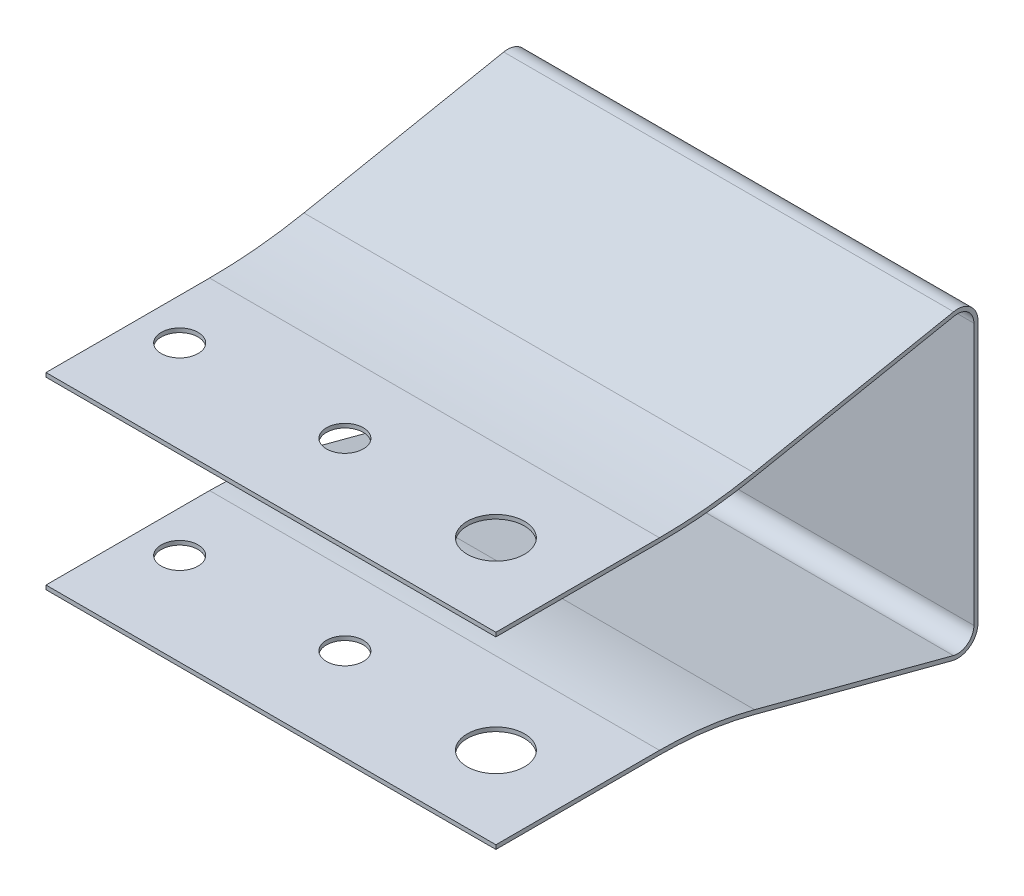
ISO-10303-21;
HEADER;
FILE_DESCRIPTION(('STEP AP214'),'2;1');
FILE_NAME('part.step','',(''),(''),'','','');
FILE_SCHEMA(('AUTOMOTIVE_DESIGN { 1 0 10303 214 1 1 1 1 }'));
ENDSEC;
DATA;
#1=APPLICATION_CONTEXT('core data for automotive mechanical design processes');
#2=APPLICATION_PROTOCOL_DEFINITION('international standard','automotive_design',2000,#1);
#3=PRODUCT_CONTEXT('',#1,'mechanical');
#4=PRODUCT('Part','Part','',(#3));
#5=PRODUCT_RELATED_PRODUCT_CATEGORY('part','',(#4));
#6=PRODUCT_DEFINITION_FORMATION('','',#4);
#7=PRODUCT_DEFINITION_CONTEXT('part definition',#1,'design');
#8=PRODUCT_DEFINITION('design','',#6,#7);
#9=PRODUCT_DEFINITION_SHAPE('','',#8);
#10=(LENGTH_UNIT() NAMED_UNIT(*) SI_UNIT(.MILLI.,.METRE.));
#11=(NAMED_UNIT(*) PLANE_ANGLE_UNIT() SI_UNIT($,.RADIAN.));
#12=(NAMED_UNIT(*) SI_UNIT($,.STERADIAN.) SOLID_ANGLE_UNIT());
#13=UNCERTAINTY_MEASURE_WITH_UNIT(LENGTH_MEASURE(1.E-05),#10,'distance_accuracy_value','');
#14=(GEOMETRIC_REPRESENTATION_CONTEXT(3) GLOBAL_UNCERTAINTY_ASSIGNED_CONTEXT((#13)) GLOBAL_UNIT_ASSIGNED_CONTEXT((#10,
#11,#12)) REPRESENTATION_CONTEXT('',''));
#15=CARTESIAN_POINT('',(0.,0.,0.));
#16=DIRECTION('',(0.,0.,1.));
#17=DIRECTION('',(1.,0.,0.));
#18=AXIS2_PLACEMENT_3D('',#15,#16,#17);
#19=CARTESIAN_POINT('',(13.75,8.,-23.22));
#20=DIRECTION('',(-1.,0.,0.));
#21=DIRECTION('',(0.,0.,-1.));
#22=AXIS2_PLACEMENT_3D('',#19,#20,#21);
#23=CYLINDRICAL_SURFACE('',#22,1.);
#24=CARTESIAN_POINT('',(-13.75,8.,-23.22));
#25=DIRECTION('',(1.,0.,0.));
#26=DIRECTION('',(0.,0.,1.));
#27=AXIS2_PLACEMENT_3D('',#24,#25,#26);
#28=CIRCLE('',#27,1.);
#29=CARTESIAN_POINT('',(-13.75,8.,-24.22));
#30=VERTEX_POINT('',#29);
#31=CARTESIAN_POINT('',(-13.75,8.98104394957776,-23.0262146316233));
#32=VERTEX_POINT('',#31);
#33=EDGE_CURVE('E204',#30,#32,#28,.T.);
#34=ORIENTED_EDGE('',*,*,#33,.F.);
#35=DIRECTION('',(-1.,0.,0.));
#36=VECTOR('',#35,1.);
#37=CARTESIAN_POINT('',(13.75,8.,-24.22));
#38=LINE('',#37,#36);
#39=CARTESIAN_POINT('',(13.75,8.,-24.22));
#40=VERTEX_POINT('',#39);
#41=EDGE_CURVE('E203',#40,#30,#38,.T.);
#42=ORIENTED_EDGE('',*,*,#41,.F.);
#43=CARTESIAN_POINT('',(13.75,8.,-23.22));
#44=DIRECTION('',(1.,0.,0.));
#45=DIRECTION('',(0.,0.,1.));
#46=AXIS2_PLACEMENT_3D('',#43,#44,#45);
#47=CIRCLE('',#46,1.);
#48=CARTESIAN_POINT('',(13.75,8.98104394957776,-23.0262146316233));
#49=VERTEX_POINT('',#48);
#50=EDGE_CURVE('E259',#40,#49,#47,.T.);
#51=ORIENTED_EDGE('',*,*,#50,.T.);
#52=DIRECTION('',(-1.,0.,0.));
#53=VECTOR('',#52,1.);
#54=CARTESIAN_POINT('',(13.75,8.98104394957776,-23.0262146316233));
#55=LINE('',#54,#53);
#56=EDGE_CURVE('E11',#49,#32,#55,.T.);
#57=ORIENTED_EDGE('',*,*,#56,.T.);
#58=EDGE_LOOP('',(#34,#42,#51,#57));
#59=FACE_BOUND('',#58,.T.);
#60=ADVANCED_FACE('F34',(#59),#23,.F.);
#61=CARTESIAN_POINT('',(13.75,6.56868151266737,-10.8135610513));
#62=DIRECTION('',(0.,0.981043949577755,0.193785368376667));
#63=DIRECTION('',(0.,0.193785368376667,-0.981043949577754));
#64=AXIS2_PLACEMENT_3D('',#61,#62,#63);
#65=PLANE('',#64);
#66=DIRECTION('',(0.,-0.193785368376667,0.981043949577754));
#67=VECTOR('',#66,1.);
#68=CARTESIAN_POINT('',(-13.75,6.56868151266737,-10.8135610513));
#69=LINE('',#68,#67);
#70=CARTESIAN_POINT('',(-13.75,6.56868151266737,-10.8135610513));
#71=VERTEX_POINT('',#70);
#72=EDGE_CURVE('E206',#32,#71,#69,.T.);
#73=ORIENTED_EDGE('',*,*,#72,.F.);
#74=ORIENTED_EDGE('',*,*,#56,.F.);
#75=DIRECTION('',(0.,-0.193785368376667,0.981043949577754));
#76=VECTOR('',#75,1.);
#77=CARTESIAN_POINT('',(13.75,6.56868151266737,-10.8135610513));
#78=LINE('',#77,#76);
#79=CARTESIAN_POINT('',(13.75,6.56868151266737,-10.8135610513));
#80=VERTEX_POINT('',#79);
#81=EDGE_CURVE('E126',#49,#80,#78,.T.);
#82=ORIENTED_EDGE('',*,*,#81,.T.);
#83=DIRECTION('',(-1.,0.,0.));
#84=VECTOR('',#83,1.);
#85=CARTESIAN_POINT('',(13.75,6.56868151266737,-10.8135610513));
#86=LINE('',#85,#84);
#87=EDGE_CURVE('E43',#80,#71,#86,.T.);
#88=ORIENTED_EDGE('',*,*,#87,.T.);
#89=EDGE_LOOP('',(#73,#74,#82,#88));
#90=FACE_BOUND('',#89,.T.);
#91=ADVANCED_FACE('F430',(#90),#65,.F.);
#92=CARTESIAN_POINT('',(13.75,36.,-5.));
#93=DIRECTION('',(-1.,0.,0.));
#94=DIRECTION('',(0.,0.,-1.));
#95=AXIS2_PLACEMENT_3D('',#92,#93,#94);
#96=CYLINDRICAL_SURFACE('',#95,30.);
#97=CARTESIAN_POINT('',(-13.75,36.,-5.));
#98=DIRECTION('',(-1.,0.,0.));
#99=DIRECTION('',(0.,0.,-1.));
#100=AXIS2_PLACEMENT_3D('',#97,#98,#99);
#101=CIRCLE('',#100,30.);
#102=CARTESIAN_POINT('',(-13.75,6.,-5.));
#103=VERTEX_POINT('',#102);
#104=EDGE_CURVE('E210',#71,#103,#101,.T.);
#105=ORIENTED_EDGE('',*,*,#104,.F.);
#106=ORIENTED_EDGE('',*,*,#87,.F.);
#107=CARTESIAN_POINT('',(13.75,36.,-5.));
#108=DIRECTION('',(-1.,0.,0.));
#109=DIRECTION('',(0.,0.,-1.));
#110=AXIS2_PLACEMENT_3D('',#107,#108,#109);
#111=CIRCLE('',#110,30.);
#112=CARTESIAN_POINT('',(13.75,6.,-5.));
#113=VERTEX_POINT('',#112);
#114=EDGE_CURVE('E344',#80,#113,#111,.T.);
#115=ORIENTED_EDGE('',*,*,#114,.T.);
#116=DIRECTION('',(-1.,0.,0.));
#117=VECTOR('',#116,1.);
#118=CARTESIAN_POINT('',(13.75,6.,-5.));
#119=LINE('',#118,#117);
#120=EDGE_CURVE('E302',#113,#103,#119,.T.);
#121=ORIENTED_EDGE('',*,*,#120,.T.);
#122=EDGE_LOOP('',(#105,#106,#115,#121));
#123=FACE_BOUND('',#122,.T.);
#124=ADVANCED_FACE('F428',(#123),#96,.T.);
#125=CARTESIAN_POINT('',(13.75,6.,-5.));
#126=DIRECTION('',(0.,1.,0.));
#127=DIRECTION('',(0.,0.,-1.));
#128=AXIS2_PLACEMENT_3D('',#125,#126,#127);
#129=PLANE('',#128);
#130=CARTESIAN_POINT('',(-11.23,6.,-0.650000000000002));
#131=DIRECTION('',(0.,-1.,0.));
#132=DIRECTION('',(0.,0.,-1.));
#133=AXIS2_PLACEMENT_3D('',#130,#131,#132);
#134=CIRCLE('',#133,1.125);
#135=CARTESIAN_POINT('',(-11.23,6.,-1.775));
#136=VERTEX_POINT('',#135);
#137=EDGE_CURVE('E314',#136,#136,#134,.T.);
#138=ORIENTED_EDGE('',*,*,#137,.F.);
#139=EDGE_LOOP('',(#138));
#140=FACE_BOUND('',#139,.T.);
#141=CARTESIAN_POINT('',(-1.13,6.,-0.650000000000001));
#142=DIRECTION('',(0.,-1.,0.));
#143=DIRECTION('',(0.,0.,-1.));
#144=AXIS2_PLACEMENT_3D('',#141,#142,#143);
#145=CIRCLE('',#144,1.125);
#146=CARTESIAN_POINT('',(-1.13,6.,-1.775));
#147=VERTEX_POINT('',#146);
#148=EDGE_CURVE('E310',#147,#147,#145,.T.);
#149=ORIENTED_EDGE('',*,*,#148,.F.);
#150=EDGE_LOOP('',(#149));
#151=FACE_BOUND('',#150,.T.);
#152=CARTESIAN_POINT('',(8.75,6.,0.));
#153=DIRECTION('',(0.,-1.,0.));
#154=DIRECTION('',(0.,0.,-1.));
#155=AXIS2_PLACEMENT_3D('',#152,#153,#154);
#156=CIRCLE('',#155,1.75);
#157=CARTESIAN_POINT('',(8.75,6.,-1.75));
#158=VERTEX_POINT('',#157);
#159=EDGE_CURVE('E207',#158,#158,#156,.T.);
#160=ORIENTED_EDGE('',*,*,#159,.F.);
#161=EDGE_LOOP('',(#160));
#162=FACE_BOUND('',#161,.T.);
#163=DIRECTION('',(0.,0.,1.));
#164=VECTOR('',#163,1.);
#165=CARTESIAN_POINT('',(-13.75,6.,-5.));
#166=LINE('',#165,#164);
#167=CARTESIAN_POINT('',(-13.75,6.,5.));
#168=VERTEX_POINT('',#167);
#169=EDGE_CURVE('E213',#103,#168,#166,.T.);
#170=ORIENTED_EDGE('',*,*,#169,.F.);
#171=ORIENTED_EDGE('',*,*,#120,.F.);
#172=DIRECTION('',(0.,0.,1.));
#173=VECTOR('',#172,1.);
#174=CARTESIAN_POINT('',(13.75,6.,-5.));
#175=LINE('',#174,#173);
#176=CARTESIAN_POINT('',(13.75,6.,5.));
#177=VERTEX_POINT('',#176);
#178=EDGE_CURVE('E347',#113,#177,#175,.T.);
#179=ORIENTED_EDGE('',*,*,#178,.T.);
#180=DIRECTION('',(-1.,0.,0.));
#181=VECTOR('',#180,1.);
#182=CARTESIAN_POINT('',(13.75,6.,5.));
#183=LINE('',#182,#181);
#184=EDGE_CURVE('E299',#177,#168,#183,.T.);
#185=ORIENTED_EDGE('',*,*,#184,.T.);
#186=EDGE_LOOP('',(#170,#171,#179,#185));
#187=FACE_BOUND('',#186,.T.);
#188=ADVANCED_FACE('F426',(#140,#151,#162,#187),#129,.F.);
#189=CARTESIAN_POINT('',(13.75,6.25,5.));
#190=DIRECTION('',(0.,0.,-1.));
#191=DIRECTION('',(1.,0.,0.));
#192=AXIS2_PLACEMENT_3D('',#189,#190,#191);
#193=PLANE('',#192);
#194=DIRECTION('',(0.,1.,0.));
#195=VECTOR('',#194,1.);
#196=CARTESIAN_POINT('',(-13.75,6.25,5.));
#197=LINE('',#196,#195);
#198=CARTESIAN_POINT('',(-13.75,6.25,5.));
#199=VERTEX_POINT('',#198);
#200=EDGE_CURVE('E216',#168,#199,#197,.T.);
#201=ORIENTED_EDGE('',*,*,#200,.F.);
#202=ORIENTED_EDGE('',*,*,#184,.F.);
#203=DIRECTION('',(0.,1.,0.));
#204=VECTOR('',#203,1.);
#205=CARTESIAN_POINT('',(13.75,6.25,5.));
#206=LINE('',#205,#204);
#207=CARTESIAN_POINT('',(13.75,6.25,5.));
#208=VERTEX_POINT('',#207);
#209=EDGE_CURVE('E350',#177,#208,#206,.T.);
#210=ORIENTED_EDGE('',*,*,#209,.T.);
#211=DIRECTION('',(-1.,0.,0.));
#212=VECTOR('',#211,1.);
#213=CARTESIAN_POINT('',(13.75,6.25,5.));
#214=LINE('',#213,#212);
#215=EDGE_CURVE('E296',#208,#199,#214,.T.);
#216=ORIENTED_EDGE('',*,*,#215,.T.);
#217=EDGE_LOOP('',(#201,#202,#210,#216));
#218=FACE_BOUND('',#217,.T.);
#219=ADVANCED_FACE('F422',(#218),#193,.F.);
#220=CARTESIAN_POINT('',(13.75,6.25,-5.));
#221=DIRECTION('',(0.,-1.,0.));
#222=DIRECTION('',(0.,0.,1.));
#223=AXIS2_PLACEMENT_3D('',#220,#221,#222);
#224=PLANE('',#223);
#225=CARTESIAN_POINT('',(-11.23,6.25,-0.650000000000002));
#226=DIRECTION('',(0.,1.,0.));
#227=DIRECTION('',(0.,0.,1.));
#228=AXIS2_PLACEMENT_3D('',#225,#226,#227);
#229=CIRCLE('',#228,1.125);
#230=CARTESIAN_POINT('',(-11.23,6.25,0.475));
#231=VERTEX_POINT('',#230);
#232=EDGE_CURVE('E321',#231,#231,#229,.T.);
#233=ORIENTED_EDGE('',*,*,#232,.F.);
#234=EDGE_LOOP('',(#233));
#235=FACE_BOUND('',#234,.T.);
#236=CARTESIAN_POINT('',(-1.13,6.25,-0.650000000000001));
#237=DIRECTION('',(0.,1.,0.));
#238=DIRECTION('',(0.,0.,1.));
#239=AXIS2_PLACEMENT_3D('',#236,#237,#238);
#240=CIRCLE('',#239,1.125);
#241=CARTESIAN_POINT('',(-1.13,6.25,0.474999999999999));
#242=VERTEX_POINT('',#241);
#243=EDGE_CURVE('E318',#242,#242,#240,.T.);
#244=ORIENTED_EDGE('',*,*,#243,.F.);
#245=EDGE_LOOP('',(#244));
#246=FACE_BOUND('',#245,.T.);
#247=CARTESIAN_POINT('',(8.75,6.25,0.));
#248=DIRECTION('',(0.,1.,0.));
#249=DIRECTION('',(0.,0.,1.));
#250=AXIS2_PLACEMENT_3D('',#247,#248,#249);
#251=CIRCLE('',#250,1.75);
#252=CARTESIAN_POINT('',(8.75,6.25,1.75));
#253=VERTEX_POINT('',#252);
#254=EDGE_CURVE('E336',#253,#253,#251,.T.);
#255=ORIENTED_EDGE('',*,*,#254,.F.);
#256=EDGE_LOOP('',(#255));
#257=FACE_BOUND('',#256,.T.);
#258=DIRECTION('',(0.,0.,-1.));
#259=VECTOR('',#258,1.);
#260=CARTESIAN_POINT('',(-13.75,6.25,-5.));
#261=LINE('',#260,#259);
#262=CARTESIAN_POINT('',(-13.75,6.25,-4.99999999999999));
#263=VERTEX_POINT('',#262);
#264=EDGE_CURVE('E219',#199,#263,#261,.T.);
#265=ORIENTED_EDGE('',*,*,#264,.F.);
#266=ORIENTED_EDGE('',*,*,#215,.F.);
#267=DIRECTION('',(0.,0.,-1.));
#268=VECTOR('',#267,1.);
#269=CARTESIAN_POINT('',(13.75,6.25,-5.));
#270=LINE('',#269,#268);
#271=CARTESIAN_POINT('',(13.75,6.25,-4.99999999999999));
#272=VERTEX_POINT('',#271);
#273=EDGE_CURVE('E353',#208,#272,#270,.T.);
#274=ORIENTED_EDGE('',*,*,#273,.T.);
#275=DIRECTION('',(-1.,0.,0.));
#276=VECTOR('',#275,1.);
#277=CARTESIAN_POINT('',(13.75,6.25,-4.99999999999999));
#278=LINE('',#277,#276);
#279=EDGE_CURVE('E293',#272,#263,#278,.T.);
#280=ORIENTED_EDGE('',*,*,#279,.T.);
#281=EDGE_LOOP('',(#265,#266,#274,#280));
#282=FACE_BOUND('',#281,.T.);
#283=ADVANCED_FACE('F419',(#235,#246,#257,#282),#224,.F.);
#284=CARTESIAN_POINT('',(13.75,36.,-5.));
#285=DIRECTION('',(-1.,0.,0.));
#286=DIRECTION('',(0.,0.,-1.));
#287=AXIS2_PLACEMENT_3D('',#284,#285,#286);
#288=CYLINDRICAL_SURFACE('',#287,29.75);
#289=CARTESIAN_POINT('',(-13.75,36.,-5.));
#290=DIRECTION('',(1.,0.,0.));
#291=DIRECTION('',(0.,0.,-1.));
#292=AXIS2_PLACEMENT_3D('',#289,#290,#291);
#293=CIRCLE('',#292,29.75);
#294=CARTESIAN_POINT('',(-13.75,6.81394250006181,-10.7651147092058));
#295=VERTEX_POINT('',#294);
#296=EDGE_CURVE('E222',#263,#295,#293,.T.);
#297=ORIENTED_EDGE('',*,*,#296,.F.);
#298=ORIENTED_EDGE('',*,*,#279,.F.);
#299=CARTESIAN_POINT('',(13.75,36.,-5.));
#300=DIRECTION('',(1.,0.,0.));
#301=DIRECTION('',(0.,0.,-1.));
#302=AXIS2_PLACEMENT_3D('',#299,#300,#301);
#303=CIRCLE('',#302,29.75);
#304=CARTESIAN_POINT('',(13.75,6.81394250006181,-10.7651147092058));
#305=VERTEX_POINT('',#304);
#306=EDGE_CURVE('E356',#272,#305,#303,.T.);
#307=ORIENTED_EDGE('',*,*,#306,.T.);
#308=DIRECTION('',(-1.,0.,0.));
#309=VECTOR('',#308,1.);
#310=CARTESIAN_POINT('',(13.75,6.81394250006181,-10.7651147092058));
#311=LINE('',#310,#309);
#312=EDGE_CURVE('E290',#305,#295,#311,.T.);
#313=ORIENTED_EDGE('',*,*,#312,.T.);
#314=EDGE_LOOP('',(#297,#298,#307,#313));
#315=FACE_BOUND('',#314,.T.);
#316=ADVANCED_FACE('F417',(#315),#288,.F.);
#317=CARTESIAN_POINT('',(13.75,6.81394250006181,-10.7651147092058));
#318=DIRECTION('',(0.,-0.981043949577754,-0.193785368376668));
#319=DIRECTION('',(0.,-0.193785368376668,0.981043949577754));
#320=AXIS2_PLACEMENT_3D('',#317,#318,#319);
#321=PLANE('',#320);
#322=DIRECTION('',(0.,0.193785368376668,-0.981043949577754));
#323=VECTOR('',#322,1.);
#324=CARTESIAN_POINT('',(-13.75,6.81394250006181,-10.7651147092058));
#325=LINE('',#324,#323);
#326=CARTESIAN_POINT('',(-13.75,9.22630493697219,-22.9777682895292));
#327=VERTEX_POINT('',#326);
#328=EDGE_CURVE('E225',#295,#327,#325,.T.);
#329=ORIENTED_EDGE('',*,*,#328,.F.);
#330=ORIENTED_EDGE('',*,*,#312,.F.);
#331=DIRECTION('',(0.,0.193785368376668,-0.981043949577754));
#332=VECTOR('',#331,1.);
#333=CARTESIAN_POINT('',(13.75,6.81394250006181,-10.7651147092058));
#334=LINE('',#333,#332);
#335=CARTESIAN_POINT('',(13.75,9.22630493697219,-22.9777682895292));
#336=VERTEX_POINT('',#335);
#337=EDGE_CURVE('E359',#305,#336,#334,.T.);
#338=ORIENTED_EDGE('',*,*,#337,.T.);
#339=DIRECTION('',(-1.,0.,0.));
#340=VECTOR('',#339,1.);
#341=CARTESIAN_POINT('',(13.75,9.22630493697219,-22.9777682895292));
#342=LINE('',#341,#340);
#343=EDGE_CURVE('E287',#336,#327,#342,.T.);
#344=ORIENTED_EDGE('',*,*,#343,.T.);
#345=EDGE_LOOP('',(#329,#330,#338,#344));
#346=FACE_BOUND('',#345,.T.);
#347=ADVANCED_FACE('F413',(#346),#321,.F.);
#348=CARTESIAN_POINT('',(13.75,8.,-23.22));
#349=DIRECTION('',(-1.,0.,0.));
#350=DIRECTION('',(0.,0.,-1.));
#351=AXIS2_PLACEMENT_3D('',#348,#349,#350);
#352=CYLINDRICAL_SURFACE('',#351,1.25);
#353=CARTESIAN_POINT('',(-13.75,8.,-23.22));
#354=DIRECTION('',(-1.,0.,0.));
#355=DIRECTION('',(0.,0.,1.));
#356=AXIS2_PLACEMENT_3D('',#353,#354,#355);
#357=CIRCLE('',#356,1.25);
#358=CARTESIAN_POINT('',(-13.75,8.,-24.47));
#359=VERTEX_POINT('',#358);
#360=EDGE_CURVE('E228',#327,#359,#357,.T.);
#361=ORIENTED_EDGE('',*,*,#360,.F.);
#362=ORIENTED_EDGE('',*,*,#343,.F.);
#363=CARTESIAN_POINT('',(13.75,8.,-23.22));
#364=DIRECTION('',(-1.,0.,0.));
#365=DIRECTION('',(0.,0.,1.));
#366=AXIS2_PLACEMENT_3D('',#363,#364,#365);
#367=CIRCLE('',#366,1.25);
#368=CARTESIAN_POINT('',(13.75,8.,-24.47));
#369=VERTEX_POINT('',#368);
#370=EDGE_CURVE('E362',#336,#369,#367,.T.);
#371=ORIENTED_EDGE('',*,*,#370,.T.);
#372=DIRECTION('',(-1.,0.,0.));
#373=VECTOR('',#372,1.);
#374=CARTESIAN_POINT('',(13.75,8.,-24.47));
#375=LINE('',#374,#373);
#376=EDGE_CURVE('E284',#369,#359,#375,.T.);
#377=ORIENTED_EDGE('',*,*,#376,.T.);
#378=EDGE_LOOP('',(#361,#362,#371,#377));
#379=FACE_BOUND('',#378,.T.);
#380=ADVANCED_FACE('F410',(#379),#352,.T.);
#381=CARTESIAN_POINT('',(13.75,8.,-24.47));
#382=DIRECTION('',(0.,0.,1.));
#383=DIRECTION('',(-1.,0.,0.));
#384=AXIS2_PLACEMENT_3D('',#381,#382,#383);
#385=PLANE('',#384);
#386=DIRECTION('',(0.,-1.,0.));
#387=VECTOR('',#386,1.);
#388=CARTESIAN_POINT('',(-13.75,8.,-24.47));
#389=LINE('',#388,#387);
#390=CARTESIAN_POINT('',(-13.75,-8.,-24.47));
#391=VERTEX_POINT('',#390);
#392=EDGE_CURVE('E231',#359,#391,#389,.T.);
#393=ORIENTED_EDGE('',*,*,#392,.F.);
#394=ORIENTED_EDGE('',*,*,#376,.F.);
#395=DIRECTION('',(0.,-1.,0.));
#396=VECTOR('',#395,1.);
#397=CARTESIAN_POINT('',(13.75,8.,-24.47));
#398=LINE('',#397,#396);
#399=CARTESIAN_POINT('',(13.75,-8.,-24.47));
#400=VERTEX_POINT('',#399);
#401=EDGE_CURVE('E365',#369,#400,#398,.T.);
#402=ORIENTED_EDGE('',*,*,#401,.T.);
#403=DIRECTION('',(-1.,0.,0.));
#404=VECTOR('',#403,1.);
#405=CARTESIAN_POINT('',(13.75,-8.,-24.47));
#406=LINE('',#405,#404);
#407=EDGE_CURVE('E281',#400,#391,#406,.T.);
#408=ORIENTED_EDGE('',*,*,#407,.T.);
#409=EDGE_LOOP('',(#393,#394,#402,#408));
#410=FACE_BOUND('',#409,.T.);
#411=ADVANCED_FACE('F408',(#410),#385,.F.);
#412=CARTESIAN_POINT('',(13.75,-8.,-23.22));
#413=DIRECTION('',(-1.,0.,0.));
#414=DIRECTION('',(0.,0.,-1.));
#415=AXIS2_PLACEMENT_3D('',#412,#413,#414);
#416=CYLINDRICAL_SURFACE('',#415,1.25);
#417=CARTESIAN_POINT('',(-13.75,-8.,-23.22));
#418=DIRECTION('',(-1.,0.,0.));
#419=DIRECTION('',(0.,0.,1.));
#420=AXIS2_PLACEMENT_3D('',#417,#418,#419);
#421=CIRCLE('',#420,1.25);
#422=CARTESIAN_POINT('',(-13.75,-9.20850235944556,-22.9005910971583));
#423=VERTEX_POINT('',#422);
#424=EDGE_CURVE('E234',#391,#423,#421,.T.);
#425=ORIENTED_EDGE('',*,*,#424,.F.);
#426=ORIENTED_EDGE('',*,*,#407,.F.);
#427=CARTESIAN_POINT('',(13.75,-8.,-23.22));
#428=DIRECTION('',(-1.,0.,0.));
#429=DIRECTION('',(0.,0.,1.));
#430=AXIS2_PLACEMENT_3D('',#427,#428,#429);
#431=CIRCLE('',#430,1.25);
#432=CARTESIAN_POINT('',(13.75,-9.20850235944556,-22.9005910971583));
#433=VERTEX_POINT('',#432);
#434=EDGE_CURVE('E368',#400,#433,#431,.T.);
#435=ORIENTED_EDGE('',*,*,#434,.T.);
#436=DIRECTION('',(-1.,0.,0.));
#437=VECTOR('',#436,1.);
#438=CARTESIAN_POINT('',(13.75,-9.20850235944556,-22.9005910971583));
#439=LINE('',#438,#437);
#440=EDGE_CURVE('E278',#433,#423,#439,.T.);
#441=ORIENTED_EDGE('',*,*,#440,.T.);
#442=EDGE_LOOP('',(#425,#426,#435,#441));
#443=FACE_BOUND('',#442,.T.);
#444=ADVANCED_FACE('F404',(#443),#416,.T.);
#445=CARTESIAN_POINT('',(13.75,-5.99699897703984,-10.7496792707317));
#446=DIRECTION('',(0.,0.966801887556448,-0.255527122273329));
#447=DIRECTION('',(0.,-0.255527122273329,-0.966801887556448));
#448=AXIS2_PLACEMENT_3D('',#445,#446,#447);
#449=PLANE('',#448);
#450=DIRECTION('',(0.,0.255527122273329,0.966801887556448));
#451=VECTOR('',#450,1.);
#452=CARTESIAN_POINT('',(-13.75,-5.99699897703984,-10.7496792707317));
#453=LINE('',#452,#451);
#454=CARTESIAN_POINT('',(-13.75,-5.99699897703983,-10.7496792707317));
#455=VERTEX_POINT('',#454);
#456=EDGE_CURVE('E237',#423,#455,#453,.T.);
#457=ORIENTED_EDGE('',*,*,#456,.F.);
#458=ORIENTED_EDGE('',*,*,#440,.F.);
#459=DIRECTION('',(0.,0.255527122273329,0.966801887556448));
#460=VECTOR('',#459,1.);
#461=CARTESIAN_POINT('',(13.75,-5.99699897703984,-10.7496792707317));
#462=LINE('',#461,#460);
#463=CARTESIAN_POINT('',(13.75,-5.99699897703983,-10.7496792707317));
#464=VERTEX_POINT('',#463);
#465=EDGE_CURVE('E371',#433,#464,#462,.T.);
#466=ORIENTED_EDGE('',*,*,#465,.T.);
#467=DIRECTION('',(-1.,0.,0.));
#468=VECTOR('',#467,1.);
#469=CARTESIAN_POINT('',(13.75,-5.99699897703983,-10.7496792707317));
#470=LINE('',#469,#468);
#471=EDGE_CURVE('E275',#464,#455,#470,.T.);
#472=ORIENTED_EDGE('',*,*,#471,.T.);
#473=EDGE_LOOP('',(#457,#458,#466,#472));
#474=FACE_BOUND('',#473,.T.);
#475=ADVANCED_FACE('F401',(#474),#449,.F.);
#476=CARTESIAN_POINT('',(13.75,-27.7512484764001,-5.));
#477=DIRECTION('',(-1.,0.,0.));
#478=DIRECTION('',(0.,0.,-1.));
#479=AXIS2_PLACEMENT_3D('',#476,#477,#478);
#480=CYLINDRICAL_SURFACE('',#479,22.5012484764001);
#481=CARTESIAN_POINT('',(-13.75,-27.7512484764001,-5.));
#482=DIRECTION('',(1.,0.,0.));
#483=DIRECTION('',(0.,0.,1.));
#484=AXIS2_PLACEMENT_3D('',#481,#482,#483);
#485=CIRCLE('',#484,22.5012484764001);
#486=CARTESIAN_POINT('',(-13.75,-5.25,-5.));
#487=VERTEX_POINT('',#486);
#488=EDGE_CURVE('E240',#455,#487,#485,.T.);
#489=ORIENTED_EDGE('',*,*,#488,.F.);
#490=ORIENTED_EDGE('',*,*,#471,.F.);
#491=CARTESIAN_POINT('',(13.75,-27.7512484764001,-5.));
#492=DIRECTION('',(1.,0.,0.));
#493=DIRECTION('',(0.,0.,1.));
#494=AXIS2_PLACEMENT_3D('',#491,#492,#493);
#495=CIRCLE('',#494,22.5012484764001);
#496=CARTESIAN_POINT('',(13.75,-5.25,-5.));
#497=VERTEX_POINT('',#496);
#498=EDGE_CURVE('E374',#464,#497,#495,.T.);
#499=ORIENTED_EDGE('',*,*,#498,.T.);
#500=DIRECTION('',(-1.,0.,0.));
#501=VECTOR('',#500,1.);
#502=CARTESIAN_POINT('',(13.75,-5.25,-5.));
#503=LINE('',#502,#501);
#504=EDGE_CURVE('E272',#497,#487,#503,.T.);
#505=ORIENTED_EDGE('',*,*,#504,.T.);
#506=EDGE_LOOP('',(#489,#490,#499,#505));
#507=FACE_BOUND('',#506,.T.);
#508=ADVANCED_FACE('F399',(#507),#480,.F.);
#509=CARTESIAN_POINT('',(13.75,-5.25,-5.));
#510=DIRECTION('',(0.,1.,0.));
#511=DIRECTION('',(0.,0.,-1.));
#512=AXIS2_PLACEMENT_3D('',#509,#510,#511);
#513=PLANE('',#512);
#514=CARTESIAN_POINT('',(-11.23,-5.25,-0.650000000000002));
#515=DIRECTION('',(0.,-1.,0.));
#516=DIRECTION('',(0.,0.,-1.));
#517=AXIS2_PLACEMENT_3D('',#514,#515,#516);
#518=CIRCLE('',#517,1.125);
#519=CARTESIAN_POINT('',(-11.23,-5.25,-1.775));
#520=VERTEX_POINT('',#519);
#521=EDGE_CURVE('E326',#520,#520,#518,.T.);
#522=ORIENTED_EDGE('',*,*,#521,.F.);
#523=EDGE_LOOP('',(#522));
#524=FACE_BOUND('',#523,.T.);
#525=CARTESIAN_POINT('',(-1.13,-5.25,-0.650000000000001));
#526=DIRECTION('',(0.,-1.,0.));
#527=DIRECTION('',(0.,0.,-1.));
#528=AXIS2_PLACEMENT_3D('',#525,#526,#527);
#529=CIRCLE('',#528,1.125);
#530=CARTESIAN_POINT('',(-1.13,-5.25,-1.775));
#531=VERTEX_POINT('',#530);
#532=EDGE_CURVE('E313',#531,#531,#529,.T.);
#533=ORIENTED_EDGE('',*,*,#532,.F.);
#534=EDGE_LOOP('',(#533));
#535=FACE_BOUND('',#534,.T.);
#536=CARTESIAN_POINT('',(8.75,-5.25,0.));
#537=DIRECTION('',(0.,-1.,0.));
#538=DIRECTION('',(0.,0.,-1.));
#539=AXIS2_PLACEMENT_3D('',#536,#537,#538);
#540=CIRCLE('',#539,1.75);
#541=CARTESIAN_POINT('',(8.75,-5.25,-1.75));
#542=VERTEX_POINT('',#541);
#543=EDGE_CURVE('E309',#542,#542,#540,.T.);
#544=ORIENTED_EDGE('',*,*,#543,.F.);
#545=EDGE_LOOP('',(#544));
#546=FACE_BOUND('',#545,.T.);
#547=DIRECTION('',(0.,0.,1.));
#548=VECTOR('',#547,1.);
#549=CARTESIAN_POINT('',(-13.75,-5.25,-5.));
#550=LINE('',#549,#548);
#551=CARTESIAN_POINT('',(-13.75,-5.25,5.));
#552=VERTEX_POINT('',#551);
#553=EDGE_CURVE('E243',#487,#552,#550,.T.);
#554=ORIENTED_EDGE('',*,*,#553,.F.);
#555=ORIENTED_EDGE('',*,*,#504,.F.);
#556=DIRECTION('',(0.,0.,1.));
#557=VECTOR('',#556,1.);
#558=CARTESIAN_POINT('',(13.75,-5.25,-5.));
#559=LINE('',#558,#557);
#560=CARTESIAN_POINT('',(13.75,-5.25,5.));
#561=VERTEX_POINT('',#560);
#562=EDGE_CURVE('E377',#497,#561,#559,.T.);
#563=ORIENTED_EDGE('',*,*,#562,.T.);
#564=DIRECTION('',(-1.,0.,0.));
#565=VECTOR('',#564,1.);
#566=CARTESIAN_POINT('',(13.75,-5.25,5.));
#567=LINE('',#566,#565);
#568=EDGE_CURVE('E269',#561,#552,#567,.T.);
#569=ORIENTED_EDGE('',*,*,#568,.T.);
#570=EDGE_LOOP('',(#554,#555,#563,#569));
#571=FACE_BOUND('',#570,.T.);
#572=ADVANCED_FACE('F395',(#524,#535,#546,#571),#513,.F.);
#573=CARTESIAN_POINT('',(13.75,-5.,5.));
#574=DIRECTION('',(0.,0.,-1.));
#575=DIRECTION('',(1.,0.,0.));
#576=AXIS2_PLACEMENT_3D('',#573,#574,#575);
#577=PLANE('',#576);
#578=DIRECTION('',(0.,1.,0.));
#579=VECTOR('',#578,1.);
#580=CARTESIAN_POINT('',(-13.75,-5.,5.));
#581=LINE('',#580,#579);
#582=CARTESIAN_POINT('',(-13.75,-5.,5.));
#583=VERTEX_POINT('',#582);
#584=EDGE_CURVE('E246',#552,#583,#581,.T.);
#585=ORIENTED_EDGE('',*,*,#584,.F.);
#586=ORIENTED_EDGE('',*,*,#568,.F.);
#587=DIRECTION('',(0.,1.,0.));
#588=VECTOR('',#587,1.);
#589=CARTESIAN_POINT('',(13.75,-5.,5.));
#590=LINE('',#589,#588);
#591=CARTESIAN_POINT('',(13.75,-5.,5.));
#592=VERTEX_POINT('',#591);
#593=EDGE_CURVE('E380',#561,#592,#590,.T.);
#594=ORIENTED_EDGE('',*,*,#593,.T.);
#595=DIRECTION('',(-1.,0.,0.));
#596=VECTOR('',#595,1.);
#597=CARTESIAN_POINT('',(13.75,-5.,5.));
#598=LINE('',#597,#596);
#599=EDGE_CURVE('E266',#592,#583,#598,.T.);
#600=ORIENTED_EDGE('',*,*,#599,.T.);
#601=EDGE_LOOP('',(#585,#586,#594,#600));
#602=FACE_BOUND('',#601,.T.);
#603=ADVANCED_FACE('F392',(#602),#577,.F.);
#604=CARTESIAN_POINT('',(13.75,-5.,-5.));
#605=DIRECTION('',(0.,-1.,0.));
#606=DIRECTION('',(0.,0.,1.));
#607=AXIS2_PLACEMENT_3D('',#604,#605,#606);
#608=PLANE('',#607);
#609=CARTESIAN_POINT('',(-11.23,-5.,-0.650000000000002));
#610=DIRECTION('',(0.,1.,0.));
#611=DIRECTION('',(0.,0.,1.));
#612=AXIS2_PLACEMENT_3D('',#609,#610,#611);
#613=CIRCLE('',#612,1.125);
#614=CARTESIAN_POINT('',(-11.23,-5.,0.475));
#615=VERTEX_POINT('',#614);
#616=EDGE_CURVE('E37',#615,#615,#613,.T.);
#617=ORIENTED_EDGE('',*,*,#616,.F.);
#618=EDGE_LOOP('',(#617));
#619=FACE_BOUND('',#618,.T.);
#620=CARTESIAN_POINT('',(-1.13,-5.,-0.650000000000001));
#621=DIRECTION('',(0.,1.,0.));
#622=DIRECTION('',(0.,0.,1.));
#623=AXIS2_PLACEMENT_3D('',#620,#621,#622);
#624=CIRCLE('',#623,1.125);
#625=CARTESIAN_POINT('',(-1.13,-5.,0.474999999999999));
#626=VERTEX_POINT('',#625);
#627=EDGE_CURVE('E311',#626,#626,#624,.T.);
#628=ORIENTED_EDGE('',*,*,#627,.F.);
#629=EDGE_LOOP('',(#628));
#630=FACE_BOUND('',#629,.T.);
#631=CARTESIAN_POINT('',(8.75,-5.,0.));
#632=DIRECTION('',(0.,1.,0.));
#633=DIRECTION('',(0.,0.,1.));
#634=AXIS2_PLACEMENT_3D('',#631,#632,#633);
#635=CIRCLE('',#634,1.75);
#636=CARTESIAN_POINT('',(8.75,-5.,1.75));
#637=VERTEX_POINT('',#636);
#638=EDGE_CURVE('E307',#637,#637,#635,.T.);
#639=ORIENTED_EDGE('',*,*,#638,.F.);
#640=EDGE_LOOP('',(#639));
#641=FACE_BOUND('',#640,.T.);
#642=DIRECTION('',(0.,0.,-1.));
#643=VECTOR('',#642,1.);
#644=CARTESIAN_POINT('',(-13.75,-5.,-5.));
#645=LINE('',#644,#643);
#646=CARTESIAN_POINT('',(-13.75,-5.,-5.));
#647=VERTEX_POINT('',#646);
#648=EDGE_CURVE('E249',#583,#647,#645,.T.);
#649=ORIENTED_EDGE('',*,*,#648,.F.);
#650=ORIENTED_EDGE('',*,*,#599,.F.);
#651=DIRECTION('',(0.,0.,-1.));
#652=VECTOR('',#651,1.);
#653=CARTESIAN_POINT('',(13.75,-5.,-5.));
#654=LINE('',#653,#652);
#655=CARTESIAN_POINT('',(13.75,-5.,-5.));
#656=VERTEX_POINT('',#655);
#657=EDGE_CURVE('E198',#592,#656,#654,.T.);
#658=ORIENTED_EDGE('',*,*,#657,.T.);
#659=DIRECTION('',(-1.,0.,0.));
#660=VECTOR('',#659,1.);
#661=CARTESIAN_POINT('',(13.75,-5.,-5.));
#662=LINE('',#661,#660);
#663=EDGE_CURVE('E263',#656,#647,#662,.T.);
#664=ORIENTED_EDGE('',*,*,#663,.T.);
#665=EDGE_LOOP('',(#649,#650,#658,#664));
#666=FACE_BOUND('',#665,.T.);
#667=ADVANCED_FACE('F385',(#619,#630,#641,#666),#608,.F.);
#668=CARTESIAN_POINT('',(13.75,-27.7512484764001,-5.));
#669=DIRECTION('',(-1.,0.,0.));
#670=DIRECTION('',(0.,0.,-1.));
#671=AXIS2_PLACEMENT_3D('',#668,#669,#670);
#672=CYLINDRICAL_SURFACE('',#671,22.7512484764001);
#673=CARTESIAN_POINT('',(-13.75,-27.7512484764001,-5.));
#674=DIRECTION('',(-1.,0.,0.));
#675=DIRECTION('',(0.,0.,1.));
#676=AXIS2_PLACEMENT_3D('',#673,#674,#675);
#677=CIRCLE('',#676,22.7512484764001);
#678=CARTESIAN_POINT('',(-13.75,-5.75529850515072,-10.8135610513));
#679=VERTEX_POINT('',#678);
#680=EDGE_CURVE('E252',#647,#679,#677,.T.);
#681=ORIENTED_EDGE('',*,*,#680,.F.);
#682=ORIENTED_EDGE('',*,*,#663,.F.);
#683=CARTESIAN_POINT('',(13.75,-27.7512484764001,-5.));
#684=DIRECTION('',(-1.,0.,0.));
#685=DIRECTION('',(0.,0.,1.));
#686=AXIS2_PLACEMENT_3D('',#683,#684,#685);
#687=CIRCLE('',#686,22.7512484764001);
#688=CARTESIAN_POINT('',(13.75,-5.75529850515072,-10.8135610513));
#689=VERTEX_POINT('',#688);
#690=EDGE_CURVE('E196',#656,#689,#687,.T.);
#691=ORIENTED_EDGE('',*,*,#690,.T.);
#692=DIRECTION('',(-1.,0.,0.));
#693=VECTOR('',#692,1.);
#694=CARTESIAN_POINT('',(13.75,-5.75529850515072,-10.8135610513));
#695=LINE('',#694,#693);
#696=EDGE_CURVE('E190',#689,#679,#695,.T.);
#697=ORIENTED_EDGE('',*,*,#696,.T.);
#698=EDGE_LOOP('',(#681,#682,#691,#697));
#699=FACE_BOUND('',#698,.T.);
#700=ADVANCED_FACE('F389',(#699),#672,.T.);
#701=CARTESIAN_POINT('',(13.75,-5.75529850515072,-10.8135610513));
#702=DIRECTION('',(0.,-0.966801887556448,0.25552712227333));
#703=DIRECTION('',(0.,0.25552712227333,0.966801887556448));
#704=AXIS2_PLACEMENT_3D('',#701,#702,#703);
#705=PLANE('',#704);
#706=DIRECTION('',(0.,-0.25552712227333,-0.966801887556448));
#707=VECTOR('',#706,1.);
#708=CARTESIAN_POINT('',(-13.75,-5.75529850515072,-10.8135610513));
#709=LINE('',#708,#707);
#710=CARTESIAN_POINT('',(-13.75,-8.96680188755645,-22.9644728777267));
#711=VERTEX_POINT('',#710);
#712=EDGE_CURVE('E255',#679,#711,#709,.T.);
#713=ORIENTED_EDGE('',*,*,#712,.F.);
#714=ORIENTED_EDGE('',*,*,#696,.F.);
#715=DIRECTION('',(0.,-0.25552712227333,-0.966801887556448));
#716=VECTOR('',#715,1.);
#717=CARTESIAN_POINT('',(13.75,-5.75529850515072,-10.8135610513));
#718=LINE('',#717,#716);
#719=CARTESIAN_POINT('',(13.75,-8.96680188755645,-22.9644728777267));
#720=VERTEX_POINT('',#719);
#721=EDGE_CURVE('E180',#689,#720,#718,.T.);
#722=ORIENTED_EDGE('',*,*,#721,.T.);
#723=DIRECTION('',(-1.,0.,0.));
#724=VECTOR('',#723,1.);
#725=CARTESIAN_POINT('',(13.75,-8.96680188755645,-22.9644728777267));
#726=LINE('',#725,#724);
#727=EDGE_CURVE('E185',#720,#711,#726,.T.);
#728=ORIENTED_EDGE('',*,*,#727,.T.);
#729=EDGE_LOOP('',(#713,#714,#722,#728));
#730=FACE_BOUND('',#729,.T.);
#731=ADVANCED_FACE('F193',(#730),#705,.F.);
#732=CARTESIAN_POINT('',(13.75,-8.,-23.22));
#733=DIRECTION('',(-1.,0.,0.));
#734=DIRECTION('',(0.,0.,-1.));
#735=AXIS2_PLACEMENT_3D('',#732,#733,#734);
#736=CYLINDRICAL_SURFACE('',#735,1.);
#737=CARTESIAN_POINT('',(-13.75,-8.,-23.22));
#738=DIRECTION('',(1.,0.,0.));
#739=DIRECTION('',(0.,0.,1.));
#740=AXIS2_PLACEMENT_3D('',#737,#738,#739);
#741=CIRCLE('',#740,1.);
#742=CARTESIAN_POINT('',(-13.75,-8.,-24.22));
#743=VERTEX_POINT('',#742);
#744=EDGE_CURVE('E187',#711,#743,#741,.T.);
#745=ORIENTED_EDGE('',*,*,#744,.F.);
#746=ORIENTED_EDGE('',*,*,#727,.F.);
#747=CARTESIAN_POINT('',(13.75,-8.,-23.22));
#748=DIRECTION('',(1.,0.,0.));
#749=DIRECTION('',(0.,0.,1.));
#750=AXIS2_PLACEMENT_3D('',#747,#748,#749);
#751=CIRCLE('',#750,1.);
#752=CARTESIAN_POINT('',(13.75,-8.,-24.22));
#753=VERTEX_POINT('',#752);
#754=EDGE_CURVE('E176',#720,#753,#751,.T.);
#755=ORIENTED_EDGE('',*,*,#754,.T.);
#756=DIRECTION('',(-1.,0.,0.));
#757=VECTOR('',#756,1.);
#758=CARTESIAN_POINT('',(13.75,-8.,-24.22));
#759=LINE('',#758,#757);
#760=EDGE_CURVE('E191',#753,#743,#759,.T.);
#761=ORIENTED_EDGE('',*,*,#760,.T.);
#762=EDGE_LOOP('',(#745,#746,#755,#761));
#763=FACE_BOUND('',#762,.T.);
#764=ADVANCED_FACE('F186',(#763),#736,.F.);
#765=CARTESIAN_POINT('',(13.75,8.,-24.22));
#766=DIRECTION('',(0.,0.,-1.));
#767=DIRECTION('',(1.,0.,0.));
#768=AXIS2_PLACEMENT_3D('',#765,#766,#767);
#769=PLANE('',#768);
#770=DIRECTION('',(0.,1.,0.));
#771=VECTOR('',#770,1.);
#772=CARTESIAN_POINT('',(-13.75,8.,-24.22));
#773=LINE('',#772,#771);
#774=EDGE_CURVE('E114',#743,#30,#773,.T.);
#775=ORIENTED_EDGE('',*,*,#774,.F.);
#776=ORIENTED_EDGE('',*,*,#760,.F.);
#777=DIRECTION('',(0.,1.,0.));
#778=VECTOR('',#777,1.);
#779=CARTESIAN_POINT('',(13.75,8.,-24.22));
#780=LINE('',#779,#778);
#781=EDGE_CURVE('E52',#753,#40,#780,.T.);
#782=ORIENTED_EDGE('',*,*,#781,.T.);
#783=ORIENTED_EDGE('',*,*,#41,.T.);
#784=EDGE_LOOP('',(#775,#776,#782,#783));
#785=FACE_BOUND('',#784,.T.);
#786=ADVANCED_FACE('F434',(#785),#769,.F.);
#787=CARTESIAN_POINT('',(13.75,8.,-23.22));
#788=DIRECTION('',(1.,0.,0.));
#789=DIRECTION('',(0.,0.,1.));
#790=AXIS2_PLACEMENT_3D('',#787,#788,#789);
#791=PLANE('',#790);
#792=ORIENTED_EDGE('',*,*,#50,.F.);
#793=ORIENTED_EDGE('',*,*,#781,.F.);
#794=ORIENTED_EDGE('',*,*,#754,.F.);
#795=ORIENTED_EDGE('',*,*,#721,.F.);
#796=ORIENTED_EDGE('',*,*,#690,.F.);
#797=ORIENTED_EDGE('',*,*,#657,.F.);
#798=ORIENTED_EDGE('',*,*,#593,.F.);
#799=ORIENTED_EDGE('',*,*,#562,.F.);
#800=ORIENTED_EDGE('',*,*,#498,.F.);
#801=ORIENTED_EDGE('',*,*,#465,.F.);
#802=ORIENTED_EDGE('',*,*,#434,.F.);
#803=ORIENTED_EDGE('',*,*,#401,.F.);
#804=ORIENTED_EDGE('',*,*,#370,.F.);
#805=ORIENTED_EDGE('',*,*,#337,.F.);
#806=ORIENTED_EDGE('',*,*,#306,.F.);
#807=ORIENTED_EDGE('',*,*,#273,.F.);
#808=ORIENTED_EDGE('',*,*,#209,.F.);
#809=ORIENTED_EDGE('',*,*,#178,.F.);
#810=ORIENTED_EDGE('',*,*,#114,.F.);
#811=ORIENTED_EDGE('',*,*,#81,.F.);
#812=EDGE_LOOP('',(#792,#793,#794,#795,#796,#797,#798,#799,#800,#801,#802,#803,#804,#805,#806,
#807,#808,#809,#810,#811));
#813=FACE_BOUND('',#812,.T.);
#814=ADVANCED_FACE('F178',(#813),#791,.T.);
#815=CARTESIAN_POINT('',(-13.75,8.,-23.22));
#816=DIRECTION('',(1.,0.,0.));
#817=DIRECTION('',(0.,0.,1.));
#818=AXIS2_PLACEMENT_3D('',#815,#816,#817);
#819=PLANE('',#818);
#820=ORIENTED_EDGE('',*,*,#33,.T.);
#821=ORIENTED_EDGE('',*,*,#72,.T.);
#822=ORIENTED_EDGE('',*,*,#104,.T.);
#823=ORIENTED_EDGE('',*,*,#169,.T.);
#824=ORIENTED_EDGE('',*,*,#200,.T.);
#825=ORIENTED_EDGE('',*,*,#264,.T.);
#826=ORIENTED_EDGE('',*,*,#296,.T.);
#827=ORIENTED_EDGE('',*,*,#328,.T.);
#828=ORIENTED_EDGE('',*,*,#360,.T.);
#829=ORIENTED_EDGE('',*,*,#392,.T.);
#830=ORIENTED_EDGE('',*,*,#424,.T.);
#831=ORIENTED_EDGE('',*,*,#456,.T.);
#832=ORIENTED_EDGE('',*,*,#488,.T.);
#833=ORIENTED_EDGE('',*,*,#553,.T.);
#834=ORIENTED_EDGE('',*,*,#584,.T.);
#835=ORIENTED_EDGE('',*,*,#648,.T.);
#836=ORIENTED_EDGE('',*,*,#680,.T.);
#837=ORIENTED_EDGE('',*,*,#712,.T.);
#838=ORIENTED_EDGE('',*,*,#744,.T.);
#839=ORIENTED_EDGE('',*,*,#774,.T.);
#840=EDGE_LOOP('',(#820,#821,#822,#823,#824,#825,#826,#827,#828,#829,#830,#831,#832,#833,#834,
#835,#836,#837,#838,#839));
#841=FACE_BOUND('',#840,.T.);
#842=ADVANCED_FACE('F390',(#841),#819,.F.);
#843=CARTESIAN_POINT('',(8.75,-9.25,0.));
#844=DIRECTION('',(0.,1.,0.));
#845=DIRECTION('',(0.,0.,-1.));
#846=AXIS2_PLACEMENT_3D('',#843,#844,#845);
#847=CYLINDRICAL_SURFACE('',#846,1.75);
#848=ORIENTED_EDGE('',*,*,#638,.T.);
#849=EDGE_LOOP('',(#848));
#850=FACE_BOUND('',#849,.T.);
#851=ORIENTED_EDGE('',*,*,#543,.T.);
#852=EDGE_LOOP('',(#851));
#853=FACE_BOUND('',#852,.T.);
#854=ADVANCED_FACE('F513',(#850,#853),#847,.F.);
#855=ORIENTED_EDGE('',*,*,#254,.T.);
#856=EDGE_LOOP('',(#855));
#857=FACE_BOUND('',#856,.T.);
#858=ORIENTED_EDGE('',*,*,#159,.T.);
#859=EDGE_LOOP('',(#858));
#860=FACE_BOUND('',#859,.T.);
#861=ADVANCED_FACE('F521',(#857,#860),#847,.F.);
#862=CARTESIAN_POINT('',(-1.13,-9.25,-0.650000000000001));
#863=DIRECTION('',(0.,1.,0.));
#864=DIRECTION('',(0.,0.,-1.));
#865=AXIS2_PLACEMENT_3D('',#862,#863,#864);
#866=CYLINDRICAL_SURFACE('',#865,1.125);
#867=ORIENTED_EDGE('',*,*,#627,.T.);
#868=EDGE_LOOP('',(#867));
#869=FACE_BOUND('',#868,.T.);
#870=ORIENTED_EDGE('',*,*,#532,.T.);
#871=EDGE_LOOP('',(#870));
#872=FACE_BOUND('',#871,.T.);
#873=ADVANCED_FACE('F531',(#869,#872),#866,.F.);
#874=ORIENTED_EDGE('',*,*,#243,.T.);
#875=EDGE_LOOP('',(#874));
#876=FACE_BOUND('',#875,.T.);
#877=ORIENTED_EDGE('',*,*,#148,.T.);
#878=EDGE_LOOP('',(#877));
#879=FACE_BOUND('',#878,.T.);
#880=ADVANCED_FACE('F540',(#876,#879),#866,.F.);
#881=CARTESIAN_POINT('',(-11.23,-9.25,-0.650000000000002));
#882=DIRECTION('',(0.,1.,0.));
#883=DIRECTION('',(0.,0.,-1.));
#884=AXIS2_PLACEMENT_3D('',#881,#882,#883);
#885=CYLINDRICAL_SURFACE('',#884,1.125);
#886=ORIENTED_EDGE('',*,*,#616,.T.);
#887=EDGE_LOOP('',(#886));
#888=FACE_BOUND('',#887,.T.);
#889=ORIENTED_EDGE('',*,*,#521,.T.);
#890=EDGE_LOOP('',(#889));
#891=FACE_BOUND('',#890,.T.);
#892=ADVANCED_FACE('F549',(#888,#891),#885,.F.);
#893=ORIENTED_EDGE('',*,*,#232,.T.);
#894=EDGE_LOOP('',(#893));
#895=FACE_BOUND('',#894,.T.);
#896=ORIENTED_EDGE('',*,*,#137,.T.);
#897=EDGE_LOOP('',(#896));
#898=FACE_BOUND('',#897,.T.);
#899=ADVANCED_FACE('F558',(#895,#898),#885,.F.);
#900=CLOSED_SHELL('',(#60,#91,#124,#188,#219,#283,#316,#347,#380,#411,#444,#475,#508,#572,#603,
#667,#700,#731,#764,#786,#814,#842,#854,#861,#873,#880,#892,#899));
#901=MANIFOLD_SOLID_BREP('B2',#900);
#902=ADVANCED_BREP_SHAPE_REPRESENTATION('',(#18,#901),#14);
#903=SHAPE_DEFINITION_REPRESENTATION(#9,#902);
ENDSEC;
END-ISO-10303-21;
